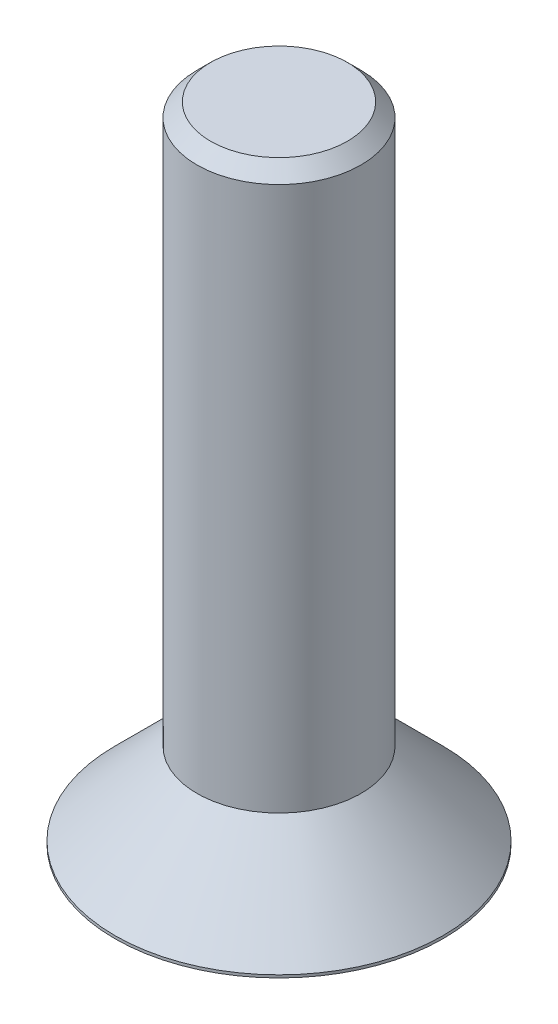
ISO-10303-21;
HEADER;
FILE_DESCRIPTION(('STEP AP214'),'2;1');
FILE_NAME('part.step','',(''),(''),'','','');
FILE_SCHEMA(('AUTOMOTIVE_DESIGN { 1 0 10303 214 1 1 1 1 }'));
ENDSEC;
DATA;
#1=APPLICATION_CONTEXT('core data for automotive mechanical design processes');
#2=APPLICATION_PROTOCOL_DEFINITION('international standard','automotive_design',2000,#1);
#3=PRODUCT_CONTEXT('',#1,'mechanical');
#4=PRODUCT('Part','Part','',(#3));
#5=PRODUCT_RELATED_PRODUCT_CATEGORY('part','',(#4));
#6=PRODUCT_DEFINITION_FORMATION('','',#4);
#7=PRODUCT_DEFINITION_CONTEXT('part definition',#1,'design');
#8=PRODUCT_DEFINITION('design','',#6,#7);
#9=PRODUCT_DEFINITION_SHAPE('','',#8);
#10=(LENGTH_UNIT() NAMED_UNIT(*) SI_UNIT(.MILLI.,.METRE.));
#11=(NAMED_UNIT(*) PLANE_ANGLE_UNIT() SI_UNIT($,.RADIAN.));
#12=(NAMED_UNIT(*) SI_UNIT($,.STERADIAN.) SOLID_ANGLE_UNIT());
#13=UNCERTAINTY_MEASURE_WITH_UNIT(LENGTH_MEASURE(1.E-05),#10,'distance_accuracy_value','');
#14=(GEOMETRIC_REPRESENTATION_CONTEXT(3) GLOBAL_UNCERTAINTY_ASSIGNED_CONTEXT((#13)) GLOBAL_UNIT_ASSIGNED_CONTEXT((#10,
#11,#12)) REPRESENTATION_CONTEXT('',''));
#15=CARTESIAN_POINT('',(0.,0.,0.));
#16=DIRECTION('',(0.,0.,1.));
#17=DIRECTION('',(1.,0.,0.));
#18=AXIS2_PLACEMENT_3D('',#15,#16,#17);
#19=CARTESIAN_POINT('',(0.,1.75,0.));
#20=DIRECTION('',(0.,-1.,0.));
#21=DIRECTION('',(0.,0.,-1.));
#22=AXIS2_PLACEMENT_3D('',#19,#20,#21);
#23=CYLINDRICAL_SURFACE('',#22,3.);
#24=CARTESIAN_POINT('',(0.,0.0499999999999882,0.));
#25=DIRECTION('',(0.,1.,0.));
#26=DIRECTION('',(0.,0.,1.));
#27=AXIS2_PLACEMENT_3D('',#24,#25,#26);
#28=CIRCLE('',#27,3.);
#29=CARTESIAN_POINT('',(0.,0.0499999999999882,3.));
#30=VERTEX_POINT('',#29);
#31=EDGE_CURVE('E49',#30,#30,#28,.F.);
#32=ORIENTED_EDGE('',*,*,#31,.T.);
#33=EDGE_LOOP('',(#32));
#34=FACE_BOUND('',#33,.T.);
#35=CARTESIAN_POINT('',(0.,0.,0.));
#36=DIRECTION('',(0.,1.,0.));
#37=DIRECTION('',(0.,0.,1.));
#38=AXIS2_PLACEMENT_3D('',#35,#36,#37);
#39=CIRCLE('',#38,3.);
#40=CARTESIAN_POINT('',(0.,0.,3.));
#41=VERTEX_POINT('',#40);
#42=EDGE_CURVE('E54',#41,#41,#39,.T.);
#43=ORIENTED_EDGE('',*,*,#42,.T.);
#44=EDGE_LOOP('',(#43));
#45=FACE_BOUND('',#44,.T.);
#46=ADVANCED_FACE('F34',(#34,#45),#23,.T.);
#47=CARTESIAN_POINT('',(0.,0.,0.));
#48=DIRECTION('',(0.,1.,0.));
#49=DIRECTION('',(0.,0.,1.));
#50=AXIS2_PLACEMENT_3D('',#47,#48,#49);
#51=PLANE('',#50);
#52=ORIENTED_EDGE('',*,*,#42,.F.);
#53=EDGE_LOOP('',(#52));
#54=FACE_BOUND('',#53,.T.);
#55=ADVANCED_FACE('F59',(#54),#51,.F.);
#56=CARTESIAN_POINT('',(0.,11.75,0.));
#57=DIRECTION('',(0.,-1.,0.));
#58=DIRECTION('',(0.,0.,-1.));
#59=AXIS2_PLACEMENT_3D('',#56,#57,#58);
#60=CYLINDRICAL_SURFACE('',#59,1.5);
#61=CARTESIAN_POINT('',(0.,11.5,0.));
#62=DIRECTION('',(0.,1.,0.));
#63=DIRECTION('',(0.,0.,1.));
#64=AXIS2_PLACEMENT_3D('',#61,#62,#63);
#65=CIRCLE('',#64,1.5);
#66=CARTESIAN_POINT('',(0.,11.5,1.5));
#67=VERTEX_POINT('',#66);
#68=EDGE_CURVE('E10',#67,#67,#65,.F.);
#69=ORIENTED_EDGE('',*,*,#68,.T.);
#70=EDGE_LOOP('',(#69));
#71=FACE_BOUND('',#70,.T.);
#72=CARTESIAN_POINT('',(0.,1.54999999999997,0.));
#73=DIRECTION('',(0.,-1.,0.));
#74=DIRECTION('',(0.,0.,-1.));
#75=AXIS2_PLACEMENT_3D('',#72,#73,#74);
#76=CIRCLE('',#75,1.5);
#77=CARTESIAN_POINT('',(0.,1.54999999999997,-1.5));
#78=VERTEX_POINT('',#77);
#79=EDGE_CURVE('E45',#78,#78,#76,.F.);
#80=ORIENTED_EDGE('',*,*,#79,.T.);
#81=EDGE_LOOP('',(#80));
#82=FACE_BOUND('',#81,.T.);
#83=ADVANCED_FACE('F61',(#71,#82),#60,.T.);
#84=CARTESIAN_POINT('',(0.,11.75,0.));
#85=DIRECTION('',(0.,1.,0.));
#86=DIRECTION('',(0.,0.,1.));
#87=AXIS2_PLACEMENT_3D('',#84,#85,#86);
#88=PLANE('',#87);
#89=CARTESIAN_POINT('',(0.,11.75,0.));
#90=DIRECTION('',(0.,1.,0.));
#91=DIRECTION('',(0.,0.,1.));
#92=AXIS2_PLACEMENT_3D('',#89,#90,#91);
#93=CIRCLE('',#92,1.25);
#94=CARTESIAN_POINT('',(0.,11.75,1.25));
#95=VERTEX_POINT('',#94);
#96=EDGE_CURVE('E41',#95,#95,#93,.T.);
#97=ORIENTED_EDGE('',*,*,#96,.T.);
#98=EDGE_LOOP('',(#97));
#99=FACE_BOUND('',#98,.T.);
#100=ADVANCED_FACE('F67',(#99),#88,.T.);
#101=CARTESIAN_POINT('',(0.,1.75,0.));
#102=DIRECTION('',(0.,-1.,0.));
#103=DIRECTION('',(0.,0.,-1.));
#104=AXIS2_PLACEMENT_3D('',#101,#102,#103);
#105=CONICAL_SURFACE('',#104,1.29999999999997,0.785398163397454);
#106=ORIENTED_EDGE('',*,*,#31,.F.);
#107=EDGE_LOOP('',(#106));
#108=FACE_BOUND('',#107,.T.);
#109=ORIENTED_EDGE('',*,*,#79,.F.);
#110=EDGE_LOOP('',(#109));
#111=FACE_BOUND('',#110,.T.);
#112=ADVANCED_FACE('F72',(#108,#111),#105,.T.);
#113=CARTESIAN_POINT('',(0.,11.75,0.));
#114=DIRECTION('',(0.,-1.,0.));
#115=DIRECTION('',(0.,0.,-1.));
#116=AXIS2_PLACEMENT_3D('',#113,#114,#115);
#117=CONICAL_SURFACE('',#116,1.25,0.785398163397446);
#118=ORIENTED_EDGE('',*,*,#68,.F.);
#119=EDGE_LOOP('',(#118));
#120=FACE_BOUND('',#119,.T.);
#121=ORIENTED_EDGE('',*,*,#96,.F.);
#122=EDGE_LOOP('',(#121));
#123=FACE_BOUND('',#122,.T.);
#124=ADVANCED_FACE('F36',(#120,#123),#117,.T.);
#125=CLOSED_SHELL('',(#46,#55,#83,#100,#112,#124));
#126=MANIFOLD_SOLID_BREP('B2',#125);
#127=ADVANCED_BREP_SHAPE_REPRESENTATION('',(#18,#126),#14);
#128=SHAPE_DEFINITION_REPRESENTATION(#9,#127);
ENDSEC;
END-ISO-10303-21;
